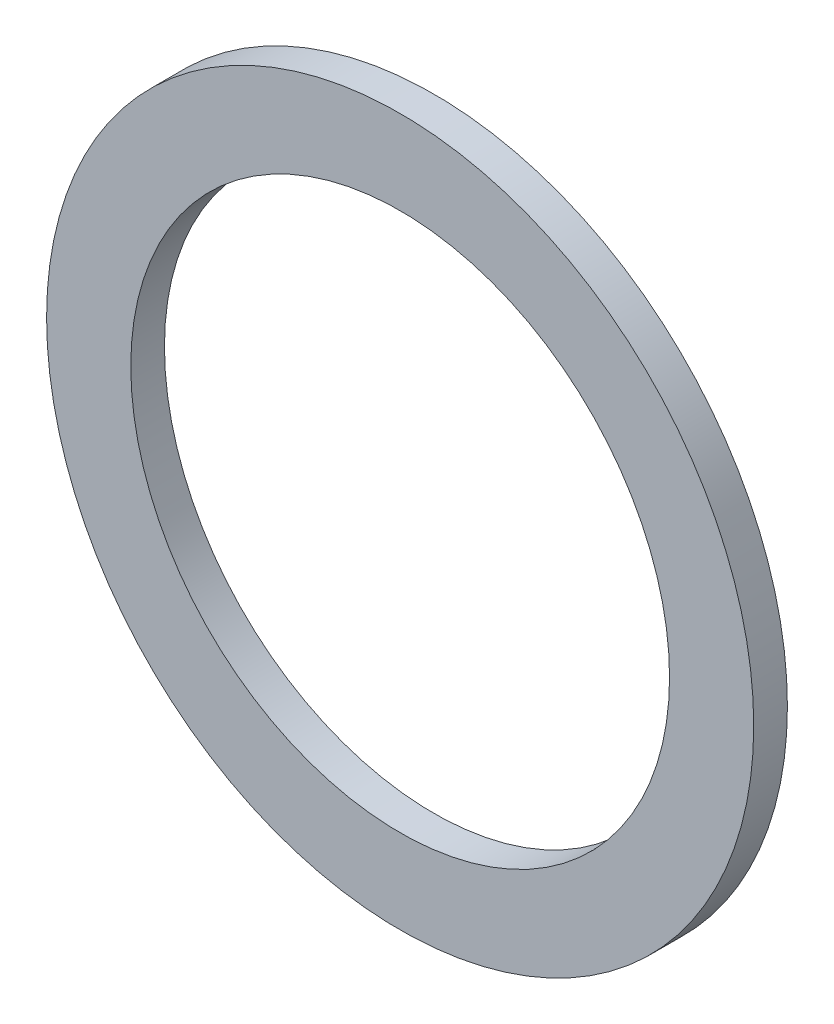
ISO-10303-21;
HEADER;
FILE_DESCRIPTION(('STEP AP214'),'2;1');
FILE_NAME('part.step','',(''),(''),'','','');
FILE_SCHEMA(('AUTOMOTIVE_DESIGN { 1 0 10303 214 1 1 1 1 }'));
ENDSEC;
DATA;
#1=APPLICATION_CONTEXT('core data for automotive mechanical design processes');
#2=APPLICATION_PROTOCOL_DEFINITION('international standard','automotive_design',2000,#1);
#3=PRODUCT_CONTEXT('',#1,'mechanical');
#4=PRODUCT('Part','Part','',(#3));
#5=PRODUCT_RELATED_PRODUCT_CATEGORY('part','',(#4));
#6=PRODUCT_DEFINITION_FORMATION('','',#4);
#7=PRODUCT_DEFINITION_CONTEXT('part definition',#1,'design');
#8=PRODUCT_DEFINITION('design','',#6,#7);
#9=PRODUCT_DEFINITION_SHAPE('','',#8);
#10=(LENGTH_UNIT() NAMED_UNIT(*) SI_UNIT(.MILLI.,.METRE.));
#11=(NAMED_UNIT(*) PLANE_ANGLE_UNIT() SI_UNIT($,.RADIAN.));
#12=(NAMED_UNIT(*) SI_UNIT($,.STERADIAN.) SOLID_ANGLE_UNIT());
#13=UNCERTAINTY_MEASURE_WITH_UNIT(LENGTH_MEASURE(1.E-05),#10,'distance_accuracy_value','');
#14=(GEOMETRIC_REPRESENTATION_CONTEXT(3) GLOBAL_UNCERTAINTY_ASSIGNED_CONTEXT((#13)) GLOBAL_UNIT_ASSIGNED_CONTEXT((#10,
#11,#12)) REPRESENTATION_CONTEXT('',''));
#15=CARTESIAN_POINT('',(0.,0.,0.));
#16=DIRECTION('',(0.,0.,1.));
#17=DIRECTION('',(1.,0.,0.));
#18=AXIS2_PLACEMENT_3D('',#15,#16,#17);
#19=CARTESIAN_POINT('',(0.,0.,0.5));
#20=DIRECTION('',(0.,0.,1.));
#21=DIRECTION('',(1.,0.,0.));
#22=AXIS2_PLACEMENT_3D('',#19,#20,#21);
#23=PLANE('',#22);
#24=CARTESIAN_POINT('',(0.,0.,0.5));
#25=DIRECTION('',(0.,0.,1.));
#26=DIRECTION('',(1.,0.,0.));
#27=AXIS2_PLACEMENT_3D('',#24,#25,#26);
#28=CIRCLE('',#27,10.5);
#29=CARTESIAN_POINT('',(10.5,0.,0.5));
#30=VERTEX_POINT('',#29);
#31=EDGE_CURVE('E10',#30,#30,#28,.T.);
#32=ORIENTED_EDGE('',*,*,#31,.T.);
#33=EDGE_LOOP('',(#32));
#34=FACE_BOUND('',#33,.T.);
#35=CARTESIAN_POINT('',(0.,0.,0.5));
#36=DIRECTION('',(0.,0.,1.));
#37=DIRECTION('',(1.,0.,0.));
#38=AXIS2_PLACEMENT_3D('',#35,#36,#37);
#39=CIRCLE('',#38,8.);
#40=CARTESIAN_POINT('',(8.,0.,0.5));
#41=VERTEX_POINT('',#40);
#42=EDGE_CURVE('E50',#41,#41,#39,.T.);
#43=ORIENTED_EDGE('',*,*,#42,.F.);
#44=EDGE_LOOP('',(#43));
#45=FACE_BOUND('',#44,.T.);
#46=ADVANCED_FACE('F39',(#34,#45),#23,.T.);
#47=CARTESIAN_POINT('',(0.,0.,-0.5));
#48=DIRECTION('',(0.,0.,1.));
#49=DIRECTION('',(1.,0.,0.));
#50=AXIS2_PLACEMENT_3D('',#47,#48,#49);
#51=PLANE('',#50);
#52=CARTESIAN_POINT('',(0.,0.,-0.5));
#53=DIRECTION('',(0.,0.,1.));
#54=DIRECTION('',(1.,0.,0.));
#55=AXIS2_PLACEMENT_3D('',#52,#53,#54);
#56=CIRCLE('',#55,10.5);
#57=CARTESIAN_POINT('',(10.5,0.,-0.5));
#58=VERTEX_POINT('',#57);
#59=EDGE_CURVE('E43',#58,#58,#56,.T.);
#60=ORIENTED_EDGE('',*,*,#59,.F.);
#61=EDGE_LOOP('',(#60));
#62=FACE_BOUND('',#61,.T.);
#63=CARTESIAN_POINT('',(0.,0.,-0.5));
#64=DIRECTION('',(0.,0.,1.));
#65=DIRECTION('',(1.,0.,0.));
#66=AXIS2_PLACEMENT_3D('',#63,#64,#65);
#67=CIRCLE('',#66,8.);
#68=CARTESIAN_POINT('',(8.,0.,-0.5));
#69=VERTEX_POINT('',#68);
#70=EDGE_CURVE('E52',#69,#69,#67,.T.);
#71=ORIENTED_EDGE('',*,*,#70,.T.);
#72=EDGE_LOOP('',(#71));
#73=FACE_BOUND('',#72,.T.);
#74=ADVANCED_FACE('F62',(#62,#73),#51,.F.);
#75=CARTESIAN_POINT('',(0.,0.,0.5));
#76=DIRECTION('',(0.,0.,-1.));
#77=DIRECTION('',(-1.,0.,0.));
#78=AXIS2_PLACEMENT_3D('',#75,#76,#77);
#79=CYLINDRICAL_SURFACE('',#78,10.5);
#80=ORIENTED_EDGE('',*,*,#31,.F.);
#81=EDGE_LOOP('',(#80));
#82=FACE_BOUND('',#81,.T.);
#83=ORIENTED_EDGE('',*,*,#59,.T.);
#84=EDGE_LOOP('',(#83));
#85=FACE_BOUND('',#84,.T.);
#86=ADVANCED_FACE('F41',(#82,#85),#79,.T.);
#87=CARTESIAN_POINT('',(0.,0.,0.5));
#88=DIRECTION('',(0.,0.,-1.));
#89=DIRECTION('',(-1.,0.,0.));
#90=AXIS2_PLACEMENT_3D('',#87,#88,#89);
#91=CYLINDRICAL_SURFACE('',#90,8.);
#92=ORIENTED_EDGE('',*,*,#42,.T.);
#93=EDGE_LOOP('',(#92));
#94=FACE_BOUND('',#93,.T.);
#95=ORIENTED_EDGE('',*,*,#70,.F.);
#96=EDGE_LOOP('',(#95));
#97=FACE_BOUND('',#96,.T.);
#98=ADVANCED_FACE('F58',(#94,#97),#91,.F.);
#99=CLOSED_SHELL('',(#46,#74,#86,#98));
#100=MANIFOLD_SOLID_BREP('B2',#99);
#101=ADVANCED_BREP_SHAPE_REPRESENTATION('',(#18,#100),#14);
#102=SHAPE_DEFINITION_REPRESENTATION(#9,#101);
ENDSEC;
END-ISO-10303-21;
